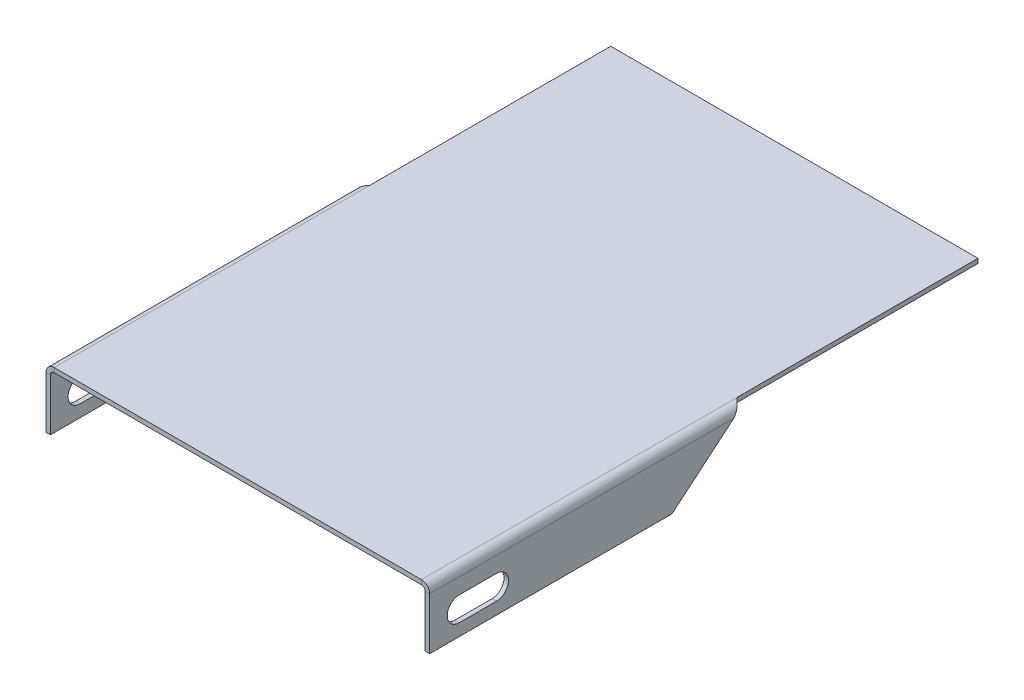
ISO-10303-21;
HEADER;
FILE_DESCRIPTION(('STEP AP214'),'2;1');
FILE_NAME('part.step','',(''),(''),'','','');
FILE_SCHEMA(('AUTOMOTIVE_DESIGN { 1 0 10303 214 1 1 1 1 }'));
ENDSEC;
DATA;
#1=APPLICATION_CONTEXT('core data for automotive mechanical design processes');
#2=APPLICATION_PROTOCOL_DEFINITION('international standard','automotive_design',2000,#1);
#3=PRODUCT_CONTEXT('',#1,'mechanical');
#4=PRODUCT('Part','Part','',(#3));
#5=PRODUCT_RELATED_PRODUCT_CATEGORY('part','',(#4));
#6=PRODUCT_DEFINITION_FORMATION('','',#4);
#7=PRODUCT_DEFINITION_CONTEXT('part definition',#1,'design');
#8=PRODUCT_DEFINITION('design','',#6,#7);
#9=PRODUCT_DEFINITION_SHAPE('','',#8);
#10=(LENGTH_UNIT() NAMED_UNIT(*) SI_UNIT(.MILLI.,.METRE.));
#11=(NAMED_UNIT(*) PLANE_ANGLE_UNIT() SI_UNIT($,.RADIAN.));
#12=(NAMED_UNIT(*) SI_UNIT($,.STERADIAN.) SOLID_ANGLE_UNIT());
#13=UNCERTAINTY_MEASURE_WITH_UNIT(LENGTH_MEASURE(1.E-05),#10,'distance_accuracy_value','');
#14=(GEOMETRIC_REPRESENTATION_CONTEXT(3) GLOBAL_UNCERTAINTY_ASSIGNED_CONTEXT((#13)) GLOBAL_UNIT_ASSIGNED_CONTEXT((#10,
#11,#12)) REPRESENTATION_CONTEXT('',''));
#15=CARTESIAN_POINT('',(0.,0.,0.));
#16=DIRECTION('',(0.,0.,1.));
#17=DIRECTION('',(1.,0.,0.));
#18=AXIS2_PLACEMENT_3D('',#15,#16,#17);
#19=CARTESIAN_POINT('',(-51.7,-8.50000000000001,142.));
#20=DIRECTION('',(-1.,0.,0.));
#21=DIRECTION('',(0.,0.,1.));
#22=AXIS2_PLACEMENT_3D('',#19,#20,#21);
#23=CYLINDRICAL_SURFACE('',#22,3.25);
#24=DIRECTION('',(-1.,0.,0.));
#25=VECTOR('',#24,1.);
#26=CARTESIAN_POINT('',(-51.7,-5.25,142.));
#27=LINE('',#26,#25);
#28=CARTESIAN_POINT('',(-50.5,-5.25,142.));
#29=VERTEX_POINT('',#28);
#30=CARTESIAN_POINT('',(-51.7,-5.25,142.));
#31=VERTEX_POINT('',#30);
#32=EDGE_CURVE('E11',#29,#31,#27,.T.);
#33=ORIENTED_EDGE('',*,*,#32,.F.);
#34=CARTESIAN_POINT('',(-50.5,-8.50000000000001,142.));
#35=DIRECTION('',(-1.,0.,0.));
#36=DIRECTION('',(0.,0.,1.));
#37=AXIS2_PLACEMENT_3D('',#34,#35,#36);
#38=CIRCLE('',#37,3.25);
#39=CARTESIAN_POINT('',(-50.5,-11.75,142.));
#40=VERTEX_POINT('',#39);
#41=EDGE_CURVE('E151',#40,#29,#38,.T.);
#42=ORIENTED_EDGE('',*,*,#41,.F.);
#43=DIRECTION('',(-1.,0.,0.));
#44=VECTOR('',#43,1.);
#45=CARTESIAN_POINT('',(-51.7,-11.75,142.));
#46=LINE('',#45,#44);
#47=CARTESIAN_POINT('',(-51.7,-11.75,142.));
#48=VERTEX_POINT('',#47);
#49=EDGE_CURVE('E49',#40,#48,#46,.T.);
#50=ORIENTED_EDGE('',*,*,#49,.T.);
#51=CARTESIAN_POINT('',(-51.7,-8.50000000000001,142.));
#52=DIRECTION('',(-1.,0.,0.));
#53=DIRECTION('',(0.,0.,1.));
#54=AXIS2_PLACEMENT_3D('',#51,#52,#53);
#55=CIRCLE('',#54,3.25);
#56=EDGE_CURVE('E414',#48,#31,#55,.T.);
#57=ORIENTED_EDGE('',*,*,#56,.T.);
#58=EDGE_LOOP('',(#33,#42,#50,#57));
#59=FACE_BOUND('',#58,.T.);
#60=ADVANCED_FACE('F39',(#59),#23,.F.);
#61=CARTESIAN_POINT('',(-51.7,-11.75,132.));
#62=DIRECTION('',(0.,-1.,0.));
#63=DIRECTION('',(0.,0.,1.));
#64=AXIS2_PLACEMENT_3D('',#61,#62,#63);
#65=PLANE('',#64);
#66=ORIENTED_EDGE('',*,*,#49,.F.);
#67=DIRECTION('',(0.,0.,1.));
#68=VECTOR('',#67,1.);
#69=CARTESIAN_POINT('',(-50.5,-11.75,150.));
#70=LINE('',#69,#68);
#71=CARTESIAN_POINT('',(-50.5,-11.75,132.));
#72=VERTEX_POINT('',#71);
#73=EDGE_CURVE('E164',#72,#40,#70,.T.);
#74=ORIENTED_EDGE('',*,*,#73,.F.);
#75=DIRECTION('',(-1.,0.,0.));
#76=VECTOR('',#75,1.);
#77=CARTESIAN_POINT('',(-51.7,-11.75,132.));
#78=LINE('',#77,#76);
#79=CARTESIAN_POINT('',(-51.7,-11.75,132.));
#80=VERTEX_POINT('',#79);
#81=EDGE_CURVE('E143',#72,#80,#78,.T.);
#82=ORIENTED_EDGE('',*,*,#81,.T.);
#83=DIRECTION('',(0.,0.,1.));
#84=VECTOR('',#83,1.);
#85=CARTESIAN_POINT('',(-51.7,-11.75,132.));
#86=LINE('',#85,#84);
#87=EDGE_CURVE('E416',#80,#48,#86,.T.);
#88=ORIENTED_EDGE('',*,*,#87,.T.);
#89=EDGE_LOOP('',(#66,#74,#82,#88));
#90=FACE_BOUND('',#89,.T.);
#91=ADVANCED_FACE('F547',(#90),#65,.F.);
#92=CARTESIAN_POINT('',(-51.7,-8.5,132.));
#93=DIRECTION('',(-1.,0.,0.));
#94=DIRECTION('',(0.,0.,1.));
#95=AXIS2_PLACEMENT_3D('',#92,#93,#94);
#96=CYLINDRICAL_SURFACE('',#95,3.25);
#97=ORIENTED_EDGE('',*,*,#81,.F.);
#98=CARTESIAN_POINT('',(-50.5,-8.5,132.));
#99=DIRECTION('',(-1.,0.,0.));
#100=DIRECTION('',(0.,0.,1.));
#101=AXIS2_PLACEMENT_3D('',#98,#99,#100);
#102=CIRCLE('',#101,3.25);
#103=CARTESIAN_POINT('',(-50.5,-5.25,132.));
#104=VERTEX_POINT('',#103);
#105=EDGE_CURVE('E149',#104,#72,#102,.T.);
#106=ORIENTED_EDGE('',*,*,#105,.F.);
#107=DIRECTION('',(-1.,0.,0.));
#108=VECTOR('',#107,1.);
#109=CARTESIAN_POINT('',(-51.7,-5.25,132.));
#110=LINE('',#109,#108);
#111=CARTESIAN_POINT('',(-51.7,-5.25,132.));
#112=VERTEX_POINT('',#111);
#113=EDGE_CURVE('E43',#104,#112,#110,.T.);
#114=ORIENTED_EDGE('',*,*,#113,.T.);
#115=CARTESIAN_POINT('',(-51.7,-8.5,132.));
#116=DIRECTION('',(-1.,0.,0.));
#117=DIRECTION('',(0.,0.,1.));
#118=AXIS2_PLACEMENT_3D('',#115,#116,#117);
#119=CIRCLE('',#118,3.25);
#120=EDGE_CURVE('E405',#112,#80,#119,.T.);
#121=ORIENTED_EDGE('',*,*,#120,.T.);
#122=EDGE_LOOP('',(#97,#106,#114,#121));
#123=FACE_BOUND('',#122,.T.);
#124=ADVANCED_FACE('F153',(#123),#96,.F.);
#125=CARTESIAN_POINT('',(51.7,-8.50000000000001,142.));
#126=DIRECTION('',(1.,0.,0.));
#127=DIRECTION('',(0.,0.,-1.));
#128=AXIS2_PLACEMENT_3D('',#125,#126,#127);
#129=CYLINDRICAL_SURFACE('',#128,3.25);
#130=DIRECTION('',(1.,0.,0.));
#131=VECTOR('',#130,1.);
#132=CARTESIAN_POINT('',(51.7,-11.75,142.));
#133=LINE('',#132,#131);
#134=CARTESIAN_POINT('',(50.5,-11.75,142.));
#135=VERTEX_POINT('',#134);
#136=CARTESIAN_POINT('',(51.7,-11.75,142.));
#137=VERTEX_POINT('',#136);
#138=EDGE_CURVE('E144',#135,#137,#133,.T.);
#139=ORIENTED_EDGE('',*,*,#138,.F.);
#140=CARTESIAN_POINT('',(50.5,-8.50000000000001,142.));
#141=DIRECTION('',(-1.,0.,0.));
#142=DIRECTION('',(0.,0.,1.));
#143=AXIS2_PLACEMENT_3D('',#140,#141,#142);
#144=CIRCLE('',#143,3.25);
#145=CARTESIAN_POINT('',(50.5,-5.25000000000001,142.));
#146=VERTEX_POINT('',#145);
#147=EDGE_CURVE('E511',#135,#146,#144,.T.);
#148=ORIENTED_EDGE('',*,*,#147,.T.);
#149=DIRECTION('',(1.,0.,0.));
#150=VECTOR('',#149,1.);
#151=CARTESIAN_POINT('',(51.7,-5.25000000000001,142.));
#152=LINE('',#151,#150);
#153=CARTESIAN_POINT('',(51.7,-5.25000000000001,142.));
#154=VERTEX_POINT('',#153);
#155=EDGE_CURVE('E529',#146,#154,#152,.T.);
#156=ORIENTED_EDGE('',*,*,#155,.T.);
#157=CARTESIAN_POINT('',(51.7,-8.50000000000001,142.));
#158=DIRECTION('',(-1.,0.,0.));
#159=DIRECTION('',(0.,0.,1.));
#160=AXIS2_PLACEMENT_3D('',#157,#158,#159);
#161=CIRCLE('',#160,3.25);
#162=EDGE_CURVE('E441',#137,#154,#161,.T.);
#163=ORIENTED_EDGE('',*,*,#162,.F.);
#164=EDGE_LOOP('',(#139,#148,#156,#163));
#165=FACE_BOUND('',#164,.T.);
#166=ADVANCED_FACE('F703',(#165),#129,.F.);
#167=CARTESIAN_POINT('',(51.7,-5.25000000000001,132.));
#168=DIRECTION('',(0.,-1.,0.));
#169=DIRECTION('',(0.,0.,-1.));
#170=AXIS2_PLACEMENT_3D('',#167,#168,#169);
#171=PLANE('',#170);
#172=ORIENTED_EDGE('',*,*,#155,.F.);
#173=DIRECTION('',(0.,0.,-1.));
#174=VECTOR('',#173,1.);
#175=CARTESIAN_POINT('',(50.5,-5.25000000000001,150.));
#176=LINE('',#175,#174);
#177=CARTESIAN_POINT('',(50.5,-5.25000000000001,132.));
#178=VERTEX_POINT('',#177);
#179=EDGE_CURVE('E455',#146,#178,#176,.T.);
#180=ORIENTED_EDGE('',*,*,#179,.T.);
#181=DIRECTION('',(1.,0.,0.));
#182=VECTOR('',#181,1.);
#183=CARTESIAN_POINT('',(51.7,-5.25000000000001,132.));
#184=LINE('',#183,#182);
#185=CARTESIAN_POINT('',(51.7,-5.25000000000001,132.));
#186=VERTEX_POINT('',#185);
#187=EDGE_CURVE('E57',#178,#186,#184,.T.);
#188=ORIENTED_EDGE('',*,*,#187,.T.);
#189=DIRECTION('',(0.,0.,-1.));
#190=VECTOR('',#189,1.);
#191=CARTESIAN_POINT('',(51.7,-5.25000000000001,132.));
#192=LINE('',#191,#190);
#193=EDGE_CURVE('E444',#154,#186,#192,.T.);
#194=ORIENTED_EDGE('',*,*,#193,.F.);
#195=EDGE_LOOP('',(#172,#180,#188,#194));
#196=FACE_BOUND('',#195,.T.);
#197=ADVANCED_FACE('F708',(#196),#171,.T.);
#198=CARTESIAN_POINT('',(51.7,-8.50000000000001,132.));
#199=DIRECTION('',(1.,0.,0.));
#200=DIRECTION('',(0.,0.,-1.));
#201=AXIS2_PLACEMENT_3D('',#198,#199,#200);
#202=CYLINDRICAL_SURFACE('',#201,3.25);
#203=ORIENTED_EDGE('',*,*,#187,.F.);
#204=CARTESIAN_POINT('',(50.5,-8.50000000000001,132.));
#205=DIRECTION('',(-1.,0.,0.));
#206=DIRECTION('',(0.,0.,1.));
#207=AXIS2_PLACEMENT_3D('',#204,#205,#206);
#208=CIRCLE('',#207,3.25);
#209=CARTESIAN_POINT('',(50.5,-11.75,132.));
#210=VERTEX_POINT('',#209);
#211=EDGE_CURVE('E506',#178,#210,#208,.T.);
#212=ORIENTED_EDGE('',*,*,#211,.T.);
#213=DIRECTION('',(1.,0.,0.));
#214=VECTOR('',#213,1.);
#215=CARTESIAN_POINT('',(51.7,-11.75,132.));
#216=LINE('',#215,#214);
#217=CARTESIAN_POINT('',(51.7,-11.75,132.));
#218=VERTEX_POINT('',#217);
#219=EDGE_CURVE('E523',#210,#218,#216,.T.);
#220=ORIENTED_EDGE('',*,*,#219,.T.);
#221=CARTESIAN_POINT('',(51.7,-8.50000000000001,132.));
#222=DIRECTION('',(-1.,0.,0.));
#223=DIRECTION('',(0.,0.,1.));
#224=AXIS2_PLACEMENT_3D('',#221,#222,#223);
#225=CIRCLE('',#224,3.25);
#226=EDGE_CURVE('E435',#186,#218,#225,.T.);
#227=ORIENTED_EDGE('',*,*,#226,.F.);
#228=EDGE_LOOP('',(#203,#212,#220,#227));
#229=FACE_BOUND('',#228,.T.);
#230=ADVANCED_FACE('F527',(#229),#202,.F.);
#231=CARTESIAN_POINT('',(51.7,-15.,150.));
#232=DIRECTION('',(0.,-1.,0.));
#233=DIRECTION('',(0.,0.,-1.));
#234=AXIS2_PLACEMENT_3D('',#231,#232,#233);
#235=PLANE('',#234);
#236=DIRECTION('',(1.,0.,0.));
#237=VECTOR('',#236,1.);
#238=CARTESIAN_POINT('',(51.7,-15.,150.));
#239=LINE('',#238,#237);
#240=CARTESIAN_POINT('',(50.5,-15.,150.));
#241=VERTEX_POINT('',#240);
#242=CARTESIAN_POINT('',(51.7,-15.,150.));
#243=VERTEX_POINT('',#242);
#244=EDGE_CURVE('E532',#241,#243,#239,.T.);
#245=ORIENTED_EDGE('',*,*,#244,.F.);
#246=DIRECTION('',(0.,0.,-1.));
#247=VECTOR('',#246,1.);
#248=CARTESIAN_POINT('',(50.5,-15.,150.));
#249=LINE('',#248,#247);
#250=CARTESIAN_POINT('',(50.5,-15.,84.6797537614258));
#251=VERTEX_POINT('',#250);
#252=EDGE_CURVE('E498',#241,#251,#249,.T.);
#253=ORIENTED_EDGE('',*,*,#252,.T.);
#254=DIRECTION('',(1.,0.,0.));
#255=VECTOR('',#254,1.);
#256=CARTESIAN_POINT('',(51.7,-15.,84.6797537614258));
#257=LINE('',#256,#255);
#258=CARTESIAN_POINT('',(51.7,-15.,84.6797537614258));
#259=VERTEX_POINT('',#258);
#260=EDGE_CURVE('E567',#251,#259,#257,.T.);
#261=ORIENTED_EDGE('',*,*,#260,.T.);
#262=DIRECTION('',(0.,0.,-1.));
#263=VECTOR('',#262,1.);
#264=CARTESIAN_POINT('',(51.7,-15.,150.));
#265=LINE('',#264,#263);
#266=EDGE_CURVE('E432',#243,#259,#265,.T.);
#267=ORIENTED_EDGE('',*,*,#266,.F.);
#268=EDGE_LOOP('',(#245,#253,#261,#267));
#269=FACE_BOUND('',#268,.T.);
#270=ADVANCED_FACE('F568',(#269),#235,.T.);
#271=CARTESIAN_POINT('',(51.7,1.51327412287184,65.));
#272=DIRECTION('',(0.,0.766044443118982,0.642787609686535));
#273=DIRECTION('',(0.,-0.642787609686535,0.766044443118982));
#274=AXIS2_PLACEMENT_3D('',#271,#272,#273);
#275=PLANE('',#274);
#276=ORIENTED_EDGE('',*,*,#260,.F.);
#277=DIRECTION('',(0.,-0.642787609686535,0.766044443118982));
#278=VECTOR('',#277,1.);
#279=CARTESIAN_POINT('',(50.5,1.51327412287184,65.));
#280=LINE('',#279,#278);
#281=CARTESIAN_POINT('',(50.5,-0.99999999999998,67.9952034651066));
#282=VERTEX_POINT('',#281);
#283=EDGE_CURVE('E172',#282,#251,#280,.T.);
#284=ORIENTED_EDGE('',*,*,#283,.F.);
#285=CARTESIAN_POINT('',(51.7,-0.999999999999961,67.9952034651066));
#286=CARTESIAN_POINT('',(50.5,-0.999999999999972,67.9952034651066));
#287=B_SPLINE_CURVE_WITH_KNOTS('',1,(#285,#286),.UNSPECIFIED.,.F.,.F.,(2,2),(0.,1.),.UNSPECIFIED.);
#288=CARTESIAN_POINT('',(51.7,-0.99999999999998,67.9952034651066));
#289=VERTEX_POINT('',#288);
#290=EDGE_CURVE('E572',#282,#289,#287,.F.);
#291=ORIENTED_EDGE('',*,*,#290,.T.);
#292=DIRECTION('',(0.,-0.642787609686535,0.766044443118982));
#293=VECTOR('',#292,1.);
#294=CARTESIAN_POINT('',(51.7,1.51327412287184,65.));
#295=LINE('',#294,#293);
#296=EDGE_CURVE('E389',#289,#259,#295,.T.);
#297=ORIENTED_EDGE('',*,*,#296,.T.);
#298=EDGE_LOOP('',(#276,#284,#291,#297));
#299=FACE_BOUND('',#298,.T.);
#300=ADVANCED_FACE('F333',(#299),#275,.F.);
#301=CARTESIAN_POINT('',(51.7,-0.999999999999961,67.9952034651066));
#302=CARTESIAN_POINT('',(51.7,-0.711991024451723,67.7455774787));
#303=CARTESIAN_POINT('',(51.6427398886703,-0.424154654409548,67.4960028875888));
#304=CARTESIAN_POINT('',(51.4223300543794,0.107961756816009,66.9968023100711));
#305=CARTESIAN_POINT('',(51.259267053276,0.35200278394484,66.7472020213122));
#306=CARTESIAN_POINT('',(50.8520027839448,0.759267053276019,66.2480014437944));
#307=CARTESIAN_POINT('',(50.607961756816,0.922330054379389,65.9984011550355));
#308=CARTESIAN_POINT('',(50.0758453455904,1.14273988867031,65.4992005775178));
#309=CARTESIAN_POINT('',(49.7880089755483,1.20000000000002,65.2496259864066));
#310=CARTESIAN_POINT('',(49.5,1.20000000000002,65.));
#311=CARTESIAN_POINT('',(50.5,-0.999999999999972,67.9952034651066));
#312=CARTESIAN_POINT('',(50.5,-0.869095215219051,67.7455934690259));
#313=CARTESIAN_POINT('',(50.4739726766683,-0.738252115640694,67.4960028875888));
#314=CARTESIAN_POINT('',(50.3737863883543,-0.496381019629077,66.9968023100711));
#315=CARTESIAN_POINT('',(50.2996668423982,-0.385453280025063,66.7472020213122));
#316=CARTESIAN_POINT('',(50.1145467199749,-0.2003331576018,66.2480014437944));
#317=CARTESIAN_POINT('',(50.0036189803709,-0.126213611645722,65.9984011550355));
#318=CARTESIAN_POINT('',(49.7617478843593,-0.0260273233316658,65.4992005775178));
#319=CARTESIAN_POINT('',(49.6309047847809,0.,65.2496099960807));
#320=CARTESIAN_POINT('',(49.5,0.,65.));
#321=B_SPLINE_SURFACE_WITH_KNOTS('',1,3,((#301,#302,#303,#304,#305,#306,#307,#308,#309,#310),
(#311,#312,#313,#314,#315,#316,#317,#318,#319,#320)),.UNSPECIFIED.,.F.,.F.,.F.,(2,2),(4,2,2,2,
4),(0.,1.),(0.,0.25,0.5,0.75,1.),.UNSPECIFIED.);
#322=CARTESIAN_POINT('',(50.5,-0.999999999999972,67.9952034651066));
#323=CARTESIAN_POINT('',(50.5,-0.869095215219051,67.7455934690259));
#324=CARTESIAN_POINT('',(50.4739726766683,-0.738252115640694,67.4960028875888));
#325=CARTESIAN_POINT('',(50.3737863883543,-0.496381019629077,66.9968023100711));
#326=CARTESIAN_POINT('',(50.2996668423982,-0.385453280025063,66.7472020213122));
#327=CARTESIAN_POINT('',(50.1145467199749,-0.2003331576018,66.2480014437944));
#328=CARTESIAN_POINT('',(50.0036189803709,-0.126213611645722,65.9984011550355));
#329=CARTESIAN_POINT('',(49.7617478843593,-0.0260273233316658,65.4992005775178));
#330=CARTESIAN_POINT('',(49.6309047847809,0.,65.2496099960807));
#331=CARTESIAN_POINT('',(49.5,0.,65.));
#332=B_SPLINE_CURVE_WITH_KNOTS('',3,(#322,#323,#324,#325,#326,#327,#328,#329,#330,#331),
.UNSPECIFIED.,.F.,.F.,(4,2,2,2,4),(0.,0.25,0.5,0.75,1.),.UNSPECIFIED.);
#333=CARTESIAN_POINT('',(49.5,0.,65.));
#334=VERTEX_POINT('',#333);
#335=EDGE_CURVE('E454',#282,#334,#332,.T.);
#336=CARTESIAN_POINT('',(49.5,0.,65.));
#337=CARTESIAN_POINT('',(49.5,1.20000000000002,65.));
#338=B_SPLINE_CURVE_WITH_KNOTS('',1,(#336,#337),.UNSPECIFIED.,.F.,.F.,(2,2),(0.,1.),.UNSPECIFIED.);
#339=CARTESIAN_POINT('',(49.5,1.20000000000002,65.));
#340=VERTEX_POINT('',#339);
#341=EDGE_CURVE('E307',#334,#340,#338,.T.);
#342=CARTESIAN_POINT('',(49.5,1.20000000000002,65.));
#343=CARTESIAN_POINT('',(49.7880089755483,1.20000000000002,65.2496259864066));
#344=CARTESIAN_POINT('',(50.0758453455904,1.14273988867031,65.4992005775178));
#345=CARTESIAN_POINT('',(50.607961756816,0.922330054379389,65.9984011550355));
#346=CARTESIAN_POINT('',(50.8520027839448,0.759267053276019,66.2480014437944));
#347=CARTESIAN_POINT('',(51.259267053276,0.35200278394484,66.7472020213122));
#348=CARTESIAN_POINT('',(51.4223300543794,0.107961756816009,66.9968023100711));
#349=CARTESIAN_POINT('',(51.6427398886703,-0.424154654409548,67.4960028875888));
#350=CARTESIAN_POINT('',(51.7,-0.711991024451723,67.7455774787));
#351=CARTESIAN_POINT('',(51.7,-0.999999999999961,67.9952034651066));
#352=B_SPLINE_CURVE_WITH_KNOTS('',3,(#342,#343,#344,#345,#346,#347,#348,#349,#350,#351),
.UNSPECIFIED.,.F.,.F.,(4,2,2,2,4),(0.,0.25,0.5,0.75,1.),.UNSPECIFIED.);
#353=EDGE_CURVE('E450',#289,#340,#352,.F.);
#354=ORIENTED_EDGE('',*,*,#290,.F.);
#355=ORIENTED_EDGE('',*,*,#335,.T.);
#356=ORIENTED_EDGE('',*,*,#341,.T.);
#357=ORIENTED_EDGE('',*,*,#353,.F.);
#358=EDGE_LOOP('',(#354,#355,#356,#357));
#359=FACE_BOUND('',#358,.T.);
#360=ADVANCED_FACE('F320',(#359),#321,.T.);
#361=CARTESIAN_POINT('',(49.5,1.20000000000002,0.));
#362=DIRECTION('',(-1.,0.,0.));
#363=DIRECTION('',(0.,0.,1.));
#364=AXIS2_PLACEMENT_3D('',#361,#362,#363);
#365=PLANE('',#364);
#366=ORIENTED_EDGE('',*,*,#341,.F.);
#367=DIRECTION('',(0.,0.,1.));
#368=VECTOR('',#367,1.);
#369=CARTESIAN_POINT('',(49.5,0.,150.));
#370=LINE('',#369,#368);
#371=CARTESIAN_POINT('',(49.5,0.,0.));
#372=VERTEX_POINT('',#371);
#373=EDGE_CURVE('E178',#372,#334,#370,.T.);
#374=ORIENTED_EDGE('',*,*,#373,.F.);
#375=DIRECTION('',(0.,1.,0.));
#376=VECTOR('',#375,1.);
#377=CARTESIAN_POINT('',(49.5,1.20000000000002,0.));
#378=LINE('',#377,#376);
#379=CARTESIAN_POINT('',(49.5,1.20000000000002,0.));
#380=VERTEX_POINT('',#379);
#381=EDGE_CURVE('E304',#372,#380,#378,.T.);
#382=ORIENTED_EDGE('',*,*,#381,.T.);
#383=DIRECTION('',(0.,0.,1.));
#384=VECTOR('',#383,1.);
#385=CARTESIAN_POINT('',(49.5,1.20000000000002,0.));
#386=LINE('',#385,#384);
#387=EDGE_CURVE('E397',#380,#340,#386,.T.);
#388=ORIENTED_EDGE('',*,*,#387,.T.);
#389=EDGE_LOOP('',(#366,#374,#382,#388));
#390=FACE_BOUND('',#389,.T.);
#391=ADVANCED_FACE('F332',(#390),#365,.F.);
#392=CARTESIAN_POINT('',(-50.5,1.2,0.));
#393=DIRECTION('',(0.,0.,1.));
#394=DIRECTION('',(1.,0.,0.));
#395=AXIS2_PLACEMENT_3D('',#392,#393,#394);
#396=PLANE('',#395);
#397=ORIENTED_EDGE('',*,*,#381,.F.);
#398=DIRECTION('',(-1.,0.,0.));
#399=VECTOR('',#398,1.);
#400=CARTESIAN_POINT('',(-50.5,0.,0.));
#401=LINE('',#400,#399);
#402=CARTESIAN_POINT('',(-49.5,0.,0.));
#403=VERTEX_POINT('',#402);
#404=EDGE_CURVE('E198',#403,#372,#401,.F.);
#405=ORIENTED_EDGE('',*,*,#404,.F.);
#406=DIRECTION('',(0.,1.,0.));
#407=VECTOR('',#406,1.);
#408=CARTESIAN_POINT('',(-49.5,1.2,0.));
#409=LINE('',#408,#407);
#410=CARTESIAN_POINT('',(-49.5,1.2,0.));
#411=VERTEX_POINT('',#410);
#412=EDGE_CURVE('E296',#403,#411,#409,.T.);
#413=ORIENTED_EDGE('',*,*,#412,.T.);
#414=DIRECTION('',(1.,0.,0.));
#415=VECTOR('',#414,1.);
#416=CARTESIAN_POINT('',(-50.5,1.2,0.));
#417=LINE('',#416,#415);
#418=EDGE_CURVE('E607',#411,#380,#417,.T.);
#419=ORIENTED_EDGE('',*,*,#418,.T.);
#420=EDGE_LOOP('',(#397,#405,#413,#419));
#421=FACE_BOUND('',#420,.T.);
#422=ADVANCED_FACE('F730',(#421),#396,.F.);
#423=CARTESIAN_POINT('',(-49.5,1.2,0.));
#424=DIRECTION('',(1.,0.,0.));
#425=DIRECTION('',(0.,0.,-1.));
#426=AXIS2_PLACEMENT_3D('',#423,#424,#425);
#427=PLANE('',#426);
#428=ORIENTED_EDGE('',*,*,#412,.F.);
#429=DIRECTION('',(0.,0.,1.));
#430=VECTOR('',#429,1.);
#431=CARTESIAN_POINT('',(-49.5,0.,150.));
#432=LINE('',#431,#430);
#433=CARTESIAN_POINT('',(-49.5,0.,65.));
#434=VERTEX_POINT('',#433);
#435=EDGE_CURVE('E185',#434,#403,#432,.F.);
#436=ORIENTED_EDGE('',*,*,#435,.F.);
#437=CARTESIAN_POINT('',(-49.5,1.2,65.));
#438=CARTESIAN_POINT('',(-49.5,0.,65.));
#439=B_SPLINE_CURVE_WITH_KNOTS('',1,(#437,#438),.UNSPECIFIED.,.F.,.F.,(2,2),(0.,1.),.UNSPECIFIED.);
#440=CARTESIAN_POINT('',(-49.5,1.2,65.));
#441=VERTEX_POINT('',#440);
#442=EDGE_CURVE('E283',#434,#441,#439,.F.);
#443=ORIENTED_EDGE('',*,*,#442,.T.);
#444=DIRECTION('',(0.,0.,-1.));
#445=VECTOR('',#444,1.);
#446=CARTESIAN_POINT('',(-49.5,1.2,0.));
#447=LINE('',#446,#445);
#448=EDGE_CURVE('E612',#441,#411,#447,.T.);
#449=ORIENTED_EDGE('',*,*,#448,.T.);
#450=EDGE_LOOP('',(#428,#436,#443,#449));
#451=FACE_BOUND('',#450,.T.);
#452=ADVANCED_FACE('F237',(#451),#427,.F.);
#453=CARTESIAN_POINT('',(-49.5,1.2,65.));
#454=CARTESIAN_POINT('',(-49.7880089755482,1.2,65.2496259864066));
#455=CARTESIAN_POINT('',(-50.0758453455904,1.1427398886703,65.4992005775178));
#456=CARTESIAN_POINT('',(-50.607961756816,0.922330054379371,65.9984011550356));
#457=CARTESIAN_POINT('',(-50.8520027839448,0.759267053275999,66.2480014437945));
#458=CARTESIAN_POINT('',(-51.259267053276,0.352002783944813,66.7472020213122));
#459=CARTESIAN_POINT('',(-51.4223300543794,0.107961756815978,66.9968023100711));
#460=CARTESIAN_POINT('',(-51.6427398886703,-0.424154654409588,67.4960028875889));
#461=CARTESIAN_POINT('',(-51.7,-0.711991024451759,67.7455774787001));
#462=CARTESIAN_POINT('',(-51.7,-1.00000000000001,67.9952034651066));
#463=CARTESIAN_POINT('',(-49.5,0.,65.));
#464=CARTESIAN_POINT('',(-49.6309047847809,0.,65.2496099960807));
#465=CARTESIAN_POINT('',(-49.7617478843593,-0.0260273233316826,65.4992005775178));
#466=CARTESIAN_POINT('',(-50.0036189803709,-0.12621361164574,65.9984011550356));
#467=CARTESIAN_POINT('',(-50.1145467199749,-0.200333157601818,66.2480014437945));
#468=CARTESIAN_POINT('',(-50.2996668423982,-0.385453280025085,66.7472020213122));
#469=CARTESIAN_POINT('',(-50.3737863883543,-0.496381019629101,66.9968023100711));
#470=CARTESIAN_POINT('',(-50.4739726766683,-0.738252115640722,67.4960028875889));
#471=CARTESIAN_POINT('',(-50.5,-0.869095215219083,67.7455934690259));
#472=CARTESIAN_POINT('',(-50.5,-1.,67.9952034651066));
#473=B_SPLINE_SURFACE_WITH_KNOTS('',1,3,((#453,#454,#455,#456,#457,#458,#459,#460,#461,#462),
(#463,#464,#465,#466,#467,#468,#469,#470,#471,#472)),.UNSPECIFIED.,.F.,.F.,.F.,(2,2),(4,2,2,2,
4),(0.,1.),(0.,0.25,0.5,0.75,1.),.UNSPECIFIED.);
#474=CARTESIAN_POINT('',(-49.5,0.,65.));
#475=CARTESIAN_POINT('',(-49.6309047847809,0.,65.2496099960807));
#476=CARTESIAN_POINT('',(-49.7617478843593,-0.0260273233316826,65.4992005775178));
#477=CARTESIAN_POINT('',(-50.0036189803709,-0.12621361164574,65.9984011550356));
#478=CARTESIAN_POINT('',(-50.1145467199749,-0.200333157601818,66.2480014437945));
#479=CARTESIAN_POINT('',(-50.2996668423982,-0.385453280025085,66.7472020213122));
#480=CARTESIAN_POINT('',(-50.3737863883543,-0.496381019629101,66.9968023100711));
#481=CARTESIAN_POINT('',(-50.4739726766683,-0.738252115640722,67.4960028875889));
#482=CARTESIAN_POINT('',(-50.5,-0.869095215219083,67.7455934690259));
#483=CARTESIAN_POINT('',(-50.5,-1.,67.9952034651066));
#484=B_SPLINE_CURVE_WITH_KNOTS('',3,(#474,#475,#476,#477,#478,#479,#480,#481,#482,#483),
.UNSPECIFIED.,.F.,.F.,(4,2,2,2,4),(0.,0.25,0.5,0.75,1.),.UNSPECIFIED.);
#485=CARTESIAN_POINT('',(-50.5,-1.,67.9952034651066));
#486=VERTEX_POINT('',#485);
#487=EDGE_CURVE('E207',#434,#486,#484,.T.);
#488=CARTESIAN_POINT('',(-50.5,-1.,67.9952034651066));
#489=CARTESIAN_POINT('',(-51.7,-1.00000000000001,67.9952034651066));
#490=B_SPLINE_CURVE_WITH_KNOTS('',1,(#488,#489),.UNSPECIFIED.,.F.,.F.,(2,2),(0.,1.),.UNSPECIFIED.);
#491=CARTESIAN_POINT('',(-51.7,-1.00000000000001,67.9952034651066));
#492=VERTEX_POINT('',#491);
#493=EDGE_CURVE('E269',#486,#492,#490,.T.);
#494=CARTESIAN_POINT('',(-51.7,-1.00000000000001,67.9952034651066));
#495=CARTESIAN_POINT('',(-51.7,-0.711991024451759,67.7455774787001));
#496=CARTESIAN_POINT('',(-51.6427398886703,-0.424154654409588,67.4960028875889));
#497=CARTESIAN_POINT('',(-51.4223300543794,0.107961756815978,66.9968023100711));
#498=CARTESIAN_POINT('',(-51.259267053276,0.352002783944813,66.7472020213122));
#499=CARTESIAN_POINT('',(-50.8520027839448,0.759267053275999,66.2480014437945));
#500=CARTESIAN_POINT('',(-50.607961756816,0.922330054379371,65.9984011550356));
#501=CARTESIAN_POINT('',(-50.0758453455904,1.1427398886703,65.4992005775178));
#502=CARTESIAN_POINT('',(-49.7880089755482,1.2,65.2496259864066));
#503=CARTESIAN_POINT('',(-49.5,1.2,65.));
#504=B_SPLINE_CURVE_WITH_KNOTS('',3,(#494,#495,#496,#497,#498,#499,#500,#501,#502,#503),
.UNSPECIFIED.,.F.,.F.,(4,2,2,2,4),(0.,0.25,0.5,0.75,1.),.UNSPECIFIED.);
#505=EDGE_CURVE('E216',#441,#492,#504,.F.);
#506=ORIENTED_EDGE('',*,*,#442,.F.);
#507=ORIENTED_EDGE('',*,*,#487,.T.);
#508=ORIENTED_EDGE('',*,*,#493,.T.);
#509=ORIENTED_EDGE('',*,*,#505,.F.);
#510=EDGE_LOOP('',(#506,#507,#508,#509));
#511=FACE_BOUND('',#510,.T.);
#512=ADVANCED_FACE('F224',(#511),#473,.T.);
#513=CARTESIAN_POINT('',(-51.7,1.51327412287185,65.));
#514=DIRECTION('',(0.,0.766044443118982,0.642787609686535));
#515=DIRECTION('',(0.,0.642787609686535,-0.766044443118982));
#516=AXIS2_PLACEMENT_3D('',#513,#514,#515);
#517=PLANE('',#516);
#518=ORIENTED_EDGE('',*,*,#493,.F.);
#519=DIRECTION('',(0.,0.642787609686535,-0.766044443118982));
#520=VECTOR('',#519,1.);
#521=CARTESIAN_POINT('',(-50.5,1.51327412287185,65.));
#522=LINE('',#521,#520);
#523=CARTESIAN_POINT('',(-50.5,-15.,84.6797537614258));
#524=VERTEX_POINT('',#523);
#525=EDGE_CURVE('E190',#524,#486,#522,.T.);
#526=ORIENTED_EDGE('',*,*,#525,.F.);
#527=DIRECTION('',(-1.,0.,0.));
#528=VECTOR('',#527,1.);
#529=CARTESIAN_POINT('',(-51.7,-15.,84.6797537614258));
#530=LINE('',#529,#528);
#531=CARTESIAN_POINT('',(-51.7,-15.,84.6797537614258));
#532=VERTEX_POINT('',#531);
#533=EDGE_CURVE('E371',#524,#532,#530,.T.);
#534=ORIENTED_EDGE('',*,*,#533,.T.);
#535=DIRECTION('',(0.,0.642787609686535,-0.766044443118982));
#536=VECTOR('',#535,1.);
#537=CARTESIAN_POINT('',(-51.7,1.51327412287185,65.));
#538=LINE('',#537,#536);
#539=EDGE_CURVE('E392',#532,#492,#538,.T.);
#540=ORIENTED_EDGE('',*,*,#539,.T.);
#541=EDGE_LOOP('',(#518,#526,#534,#540));
#542=FACE_BOUND('',#541,.T.);
#543=ADVANCED_FACE('F236',(#542),#517,.F.);
#544=CARTESIAN_POINT('',(-51.7,-15.,150.));
#545=DIRECTION('',(0.,1.,0.));
#546=DIRECTION('',(0.,0.,-1.));
#547=AXIS2_PLACEMENT_3D('',#544,#545,#546);
#548=PLANE('',#547);
#549=ORIENTED_EDGE('',*,*,#533,.F.);
#550=DIRECTION('',(0.,0.,1.));
#551=VECTOR('',#550,1.);
#552=CARTESIAN_POINT('',(-50.5,-15.,150.));
#553=LINE('',#552,#551);
#554=CARTESIAN_POINT('',(-50.5,-15.,150.));
#555=VERTEX_POINT('',#554);
#556=EDGE_CURVE('E193',#555,#524,#553,.F.);
#557=ORIENTED_EDGE('',*,*,#556,.F.);
#558=DIRECTION('',(-1.,0.,0.));
#559=VECTOR('',#558,1.);
#560=CARTESIAN_POINT('',(-51.7,-15.,150.));
#561=LINE('',#560,#559);
#562=CARTESIAN_POINT('',(-51.7,-15.,150.));
#563=VERTEX_POINT('',#562);
#564=EDGE_CURVE('E369',#555,#563,#561,.T.);
#565=ORIENTED_EDGE('',*,*,#564,.T.);
#566=DIRECTION('',(0.,0.,-1.));
#567=VECTOR('',#566,1.);
#568=CARTESIAN_POINT('',(-51.7,-15.,150.));
#569=LINE('',#568,#567);
#570=EDGE_CURVE('E396',#563,#532,#569,.T.);
#571=ORIENTED_EDGE('',*,*,#570,.T.);
#572=EDGE_LOOP('',(#549,#557,#565,#571));
#573=FACE_BOUND('',#572,.T.);
#574=ADVANCED_FACE('F641',(#573),#548,.F.);
#575=CARTESIAN_POINT('',(-51.7,-15.,150.));
#576=DIRECTION('',(0.,0.,1.));
#577=DIRECTION('',(0.,1.,0.));
#578=AXIS2_PLACEMENT_3D('',#575,#576,#577);
#579=PLANE('',#578);
#580=ORIENTED_EDGE('',*,*,#564,.F.);
#581=DIRECTION('',(0.,1.,0.));
#582=VECTOR('',#581,1.);
#583=CARTESIAN_POINT('',(-50.5,-15.,150.));
#584=LINE('',#583,#582);
#585=CARTESIAN_POINT('',(-50.5,-0.999999999999999,150.));
#586=VERTEX_POINT('',#585);
#587=EDGE_CURVE('E158',#555,#586,#584,.T.);
#588=ORIENTED_EDGE('',*,*,#587,.T.);
#589=DIRECTION('',(-1.,0.,0.));
#590=VECTOR('',#589,1.);
#591=CARTESIAN_POINT('',(-51.7,-0.999999999999999,150.));
#592=LINE('',#591,#590);
#593=CARTESIAN_POINT('',(-51.7,-0.999999999999999,150.));
#594=VERTEX_POINT('',#593);
#595=EDGE_CURVE('E366',#586,#594,#592,.T.);
#596=ORIENTED_EDGE('',*,*,#595,.T.);
#597=DIRECTION('',(0.,1.,0.));
#598=VECTOR('',#597,1.);
#599=CARTESIAN_POINT('',(-51.7,-15.,150.));
#600=LINE('',#599,#598);
#601=EDGE_CURVE('E403',#563,#594,#600,.T.);
#602=ORIENTED_EDGE('',*,*,#601,.F.);
#603=EDGE_LOOP('',(#580,#588,#596,#602));
#604=FACE_BOUND('',#603,.T.);
#605=ADVANCED_FACE('F647',(#604),#579,.T.);
#606=CARTESIAN_POINT('',(-49.5,-1.,150.));
#607=DIRECTION('',(0.,0.,1.));
#608=DIRECTION('',(1.,0.,0.));
#609=AXIS2_PLACEMENT_3D('',#606,#607,#608);
#610=PLANE('',#609);
#611=ORIENTED_EDGE('',*,*,#595,.F.);
#612=CARTESIAN_POINT('',(-49.5,-1.,150.));
#613=DIRECTION('',(0.,0.,1.));
#614=DIRECTION('',(1.,0.,0.));
#615=AXIS2_PLACEMENT_3D('',#612,#613,#614);
#616=CIRCLE('',#615,1.);
#617=CARTESIAN_POINT('',(-49.5,0.,150.));
#618=VERTEX_POINT('',#617);
#619=EDGE_CURVE('E166',#586,#618,#616,.F.);
#620=ORIENTED_EDGE('',*,*,#619,.T.);
#621=DIRECTION('',(0.,1.,0.));
#622=VECTOR('',#621,1.);
#623=CARTESIAN_POINT('',(-49.5,1.2,150.));
#624=LINE('',#623,#622);
#625=CARTESIAN_POINT('',(-49.5,1.2,150.));
#626=VERTEX_POINT('',#625);
#627=EDGE_CURVE('E362',#618,#626,#624,.T.);
#628=ORIENTED_EDGE('',*,*,#627,.T.);
#629=CARTESIAN_POINT('',(-49.5,-1.,150.));
#630=DIRECTION('',(0.,0.,-1.));
#631=DIRECTION('',(-1.,0.,0.));
#632=AXIS2_PLACEMENT_3D('',#629,#630,#631);
#633=CIRCLE('',#632,2.2);
#634=EDGE_CURVE('E390',#594,#626,#633,.T.);
#635=ORIENTED_EDGE('',*,*,#634,.F.);
#636=EDGE_LOOP('',(#611,#620,#628,#635));
#637=FACE_BOUND('',#636,.T.);
#638=ADVANCED_FACE('F651',(#637),#610,.T.);
#639=CARTESIAN_POINT('',(-50.5,1.2,150.));
#640=DIRECTION('',(0.,0.,1.));
#641=DIRECTION('',(1.,0.,0.));
#642=AXIS2_PLACEMENT_3D('',#639,#640,#641);
#643=PLANE('',#642);
#644=ORIENTED_EDGE('',*,*,#627,.F.);
#645=DIRECTION('',(-1.,0.,0.));
#646=VECTOR('',#645,1.);
#647=CARTESIAN_POINT('',(-50.5,0.,150.));
#648=LINE('',#647,#646);
#649=CARTESIAN_POINT('',(49.5,0.,150.));
#650=VERTEX_POINT('',#649);
#651=EDGE_CURVE('E179',#618,#650,#648,.F.);
#652=ORIENTED_EDGE('',*,*,#651,.T.);
#653=DIRECTION('',(0.,1.,0.));
#654=VECTOR('',#653,1.);
#655=CARTESIAN_POINT('',(49.5,1.20000000000002,150.));
#656=LINE('',#655,#654);
#657=CARTESIAN_POINT('',(49.5,1.20000000000002,150.));
#658=VERTEX_POINT('',#657);
#659=EDGE_CURVE('E354',#650,#658,#656,.T.);
#660=ORIENTED_EDGE('',*,*,#659,.T.);
#661=DIRECTION('',(1.,0.,0.));
#662=VECTOR('',#661,1.);
#663=CARTESIAN_POINT('',(-50.5,1.2,150.));
#664=LINE('',#663,#662);
#665=EDGE_CURVE('E626',#626,#658,#664,.T.);
#666=ORIENTED_EDGE('',*,*,#665,.F.);
#667=EDGE_LOOP('',(#644,#652,#660,#666));
#668=FACE_BOUND('',#667,.T.);
#669=ADVANCED_FACE('F659',(#668),#643,.T.);
#670=CARTESIAN_POINT('',(49.5,-0.999999999999982,150.));
#671=DIRECTION('',(0.,0.,1.));
#672=DIRECTION('',(1.,0.,0.));
#673=AXIS2_PLACEMENT_3D('',#670,#671,#672);
#674=PLANE('',#673);
#675=ORIENTED_EDGE('',*,*,#659,.F.);
#676=CARTESIAN_POINT('',(49.5,-0.999999999999982,150.));
#677=DIRECTION('',(0.,0.,-1.));
#678=DIRECTION('',(-1.,0.,0.));
#679=AXIS2_PLACEMENT_3D('',#676,#677,#678);
#680=CIRCLE('',#679,1.);
#681=CARTESIAN_POINT('',(50.5,-0.999999999999988,150.));
#682=VERTEX_POINT('',#681);
#683=EDGE_CURVE('E451',#650,#682,#680,.T.);
#684=ORIENTED_EDGE('',*,*,#683,.T.);
#685=DIRECTION('',(1.,0.,0.));
#686=VECTOR('',#685,1.);
#687=CARTESIAN_POINT('',(51.7,-0.999999999999988,150.));
#688=LINE('',#687,#686);
#689=CARTESIAN_POINT('',(51.7,-0.999999999999988,150.));
#690=VERTEX_POINT('',#689);
#691=EDGE_CURVE('E363',#682,#690,#688,.T.);
#692=ORIENTED_EDGE('',*,*,#691,.T.);
#693=CARTESIAN_POINT('',(49.5,-0.999999999999982,150.));
#694=DIRECTION('',(0.,0.,-1.));
#695=DIRECTION('',(-1.,0.,0.));
#696=AXIS2_PLACEMENT_3D('',#693,#694,#695);
#697=CIRCLE('',#696,2.2);
#698=EDGE_CURVE('E447',#658,#690,#697,.T.);
#699=ORIENTED_EDGE('',*,*,#698,.F.);
#700=EDGE_LOOP('',(#675,#684,#692,#699));
#701=FACE_BOUND('',#700,.T.);
#702=ADVANCED_FACE('F772',(#701),#674,.T.);
#703=CARTESIAN_POINT('',(-51.7,-5.25,132.));
#704=DIRECTION('',(0.,1.,0.));
#705=DIRECTION('',(0.,0.,-1.));
#706=AXIS2_PLACEMENT_3D('',#703,#704,#705);
#707=PLANE('',#706);
#708=DIRECTION('',(0.,0.,1.));
#709=VECTOR('',#708,1.);
#710=CARTESIAN_POINT('',(-50.5,-5.25,150.));
#711=LINE('',#710,#709);
#712=EDGE_CURVE('E135',#29,#104,#711,.F.);
#713=ORIENTED_EDGE('',*,*,#712,.F.);
#714=ORIENTED_EDGE('',*,*,#32,.T.);
#715=DIRECTION('',(0.,0.,-1.));
#716=VECTOR('',#715,1.);
#717=CARTESIAN_POINT('',(-51.7,-5.25,132.));
#718=LINE('',#717,#716);
#719=EDGE_CURVE('E138',#31,#112,#718,.T.);
#720=ORIENTED_EDGE('',*,*,#719,.T.);
#721=ORIENTED_EDGE('',*,*,#113,.F.);
#722=EDGE_LOOP('',(#713,#714,#720,#721));
#723=FACE_BOUND('',#722,.T.);
#724=ADVANCED_FACE('F41',(#723),#707,.F.);
#725=CARTESIAN_POINT('',(51.7,-11.75,132.));
#726=DIRECTION('',(0.,1.,0.));
#727=DIRECTION('',(0.,0.,1.));
#728=AXIS2_PLACEMENT_3D('',#725,#726,#727);
#729=PLANE('',#728);
#730=DIRECTION('',(0.,0.,-1.));
#731=VECTOR('',#730,1.);
#732=CARTESIAN_POINT('',(50.5,-11.75,150.));
#733=LINE('',#732,#731);
#734=EDGE_CURVE('E162',#210,#135,#733,.F.);
#735=ORIENTED_EDGE('',*,*,#734,.T.);
#736=ORIENTED_EDGE('',*,*,#138,.T.);
#737=DIRECTION('',(0.,0.,1.));
#738=VECTOR('',#737,1.);
#739=CARTESIAN_POINT('',(51.7,-11.75,132.));
#740=LINE('',#739,#738);
#741=EDGE_CURVE('E438',#218,#137,#740,.T.);
#742=ORIENTED_EDGE('',*,*,#741,.F.);
#743=ORIENTED_EDGE('',*,*,#219,.F.);
#744=EDGE_LOOP('',(#735,#736,#742,#743));
#745=FACE_BOUND('',#744,.T.);
#746=ADVANCED_FACE('F520',(#745),#729,.T.);
#747=CARTESIAN_POINT('',(51.7,0.,150.));
#748=DIRECTION('',(0.,0.,-1.));
#749=DIRECTION('',(0.,1.,0.));
#750=AXIS2_PLACEMENT_3D('',#747,#748,#749);
#751=PLANE('',#750);
#752=DIRECTION('',(0.,1.,0.));
#753=VECTOR('',#752,1.);
#754=CARTESIAN_POINT('',(50.5,0.,150.));
#755=LINE('',#754,#753);
#756=EDGE_CURVE('E171',#682,#241,#755,.F.);
#757=ORIENTED_EDGE('',*,*,#756,.T.);
#758=ORIENTED_EDGE('',*,*,#244,.T.);
#759=DIRECTION('',(0.,1.,0.));
#760=VECTOR('',#759,1.);
#761=CARTESIAN_POINT('',(51.7,0.,150.));
#762=LINE('',#761,#760);
#763=EDGE_CURVE('E427',#690,#243,#762,.F.);
#764=ORIENTED_EDGE('',*,*,#763,.F.);
#765=ORIENTED_EDGE('',*,*,#691,.F.);
#766=EDGE_LOOP('',(#757,#758,#764,#765));
#767=FACE_BOUND('',#766,.T.);
#768=ADVANCED_FACE('F600',(#767),#751,.F.);
#769=CARTESIAN_POINT('',(49.5,-0.999999999999982,192.545614506668));
#770=DIRECTION('',(0.,0.,-1.));
#771=DIRECTION('',(-1.,0.,0.));
#772=AXIS2_PLACEMENT_3D('',#769,#770,#771);
#773=CYLINDRICAL_SURFACE('',#772,2.2);
#774=ORIENTED_EDGE('',*,*,#698,.T.);
#775=DIRECTION('',(0.,0.,-1.));
#776=VECTOR('',#775,1.);
#777=CARTESIAN_POINT('',(51.7,-0.999999999999994,150.));
#778=LINE('',#777,#776);
#779=EDGE_CURVE('E422',#690,#289,#778,.T.);
#780=ORIENTED_EDGE('',*,*,#779,.T.);
#781=ORIENTED_EDGE('',*,*,#353,.T.);
#782=DIRECTION('',(0.,0.,-1.));
#783=VECTOR('',#782,1.);
#784=CARTESIAN_POINT('',(49.5,1.20000000000002,150.));
#785=LINE('',#784,#783);
#786=EDGE_CURVE('E631',#658,#340,#785,.T.);
#787=ORIENTED_EDGE('',*,*,#786,.F.);
#788=EDGE_LOOP('',(#774,#780,#781,#787));
#789=FACE_BOUND('',#788,.T.);
#790=ADVANCED_FACE('F483',(#789),#773,.T.);
#791=CARTESIAN_POINT('',(51.7,0.,150.));
#792=DIRECTION('',(1.,0.,0.));
#793=DIRECTION('',(0.,0.,-1.));
#794=AXIS2_PLACEMENT_3D('',#791,#792,#793);
#795=PLANE('',#794);
#796=ORIENTED_EDGE('',*,*,#296,.F.);
#797=ORIENTED_EDGE('',*,*,#779,.F.);
#798=ORIENTED_EDGE('',*,*,#763,.T.);
#799=ORIENTED_EDGE('',*,*,#266,.T.);
#800=EDGE_LOOP('',(#796,#797,#798,#799));
#801=FACE_BOUND('',#800,.T.);
#802=ORIENTED_EDGE('',*,*,#226,.T.);
#803=ORIENTED_EDGE('',*,*,#741,.T.);
#804=ORIENTED_EDGE('',*,*,#162,.T.);
#805=ORIENTED_EDGE('',*,*,#193,.T.);
#806=EDGE_LOOP('',(#802,#803,#804,#805));
#807=FACE_BOUND('',#806,.T.);
#808=ADVANCED_FACE('F576',(#801,#807),#795,.T.);
#809=CARTESIAN_POINT('',(-49.5,-1.,22.4543854933325));
#810=DIRECTION('',(0.,0.,1.));
#811=DIRECTION('',(1.,0.,0.));
#812=AXIS2_PLACEMENT_3D('',#809,#810,#811);
#813=CYLINDRICAL_SURFACE('',#812,2.2);
#814=ORIENTED_EDGE('',*,*,#634,.T.);
#815=DIRECTION('',(0.,0.,-1.));
#816=VECTOR('',#815,1.);
#817=CARTESIAN_POINT('',(-49.5,1.2,150.));
#818=LINE('',#817,#816);
#819=EDGE_CURVE('E387',#626,#441,#818,.T.);
#820=ORIENTED_EDGE('',*,*,#819,.T.);
#821=ORIENTED_EDGE('',*,*,#505,.T.);
#822=DIRECTION('',(0.,0.,-1.));
#823=VECTOR('',#822,1.);
#824=CARTESIAN_POINT('',(-51.7,-1.,150.));
#825=LINE('',#824,#823);
#826=EDGE_CURVE('E385',#594,#492,#825,.T.);
#827=ORIENTED_EDGE('',*,*,#826,.F.);
#828=EDGE_LOOP('',(#814,#820,#821,#827));
#829=FACE_BOUND('',#828,.T.);
#830=ADVANCED_FACE('F383',(#829),#813,.T.);
#831=CARTESIAN_POINT('',(-51.7,-15.,150.));
#832=DIRECTION('',(-1.,0.,0.));
#833=DIRECTION('',(0.,0.,1.));
#834=AXIS2_PLACEMENT_3D('',#831,#832,#833);
#835=PLANE('',#834);
#836=ORIENTED_EDGE('',*,*,#539,.F.);
#837=ORIENTED_EDGE('',*,*,#570,.F.);
#838=ORIENTED_EDGE('',*,*,#601,.T.);
#839=ORIENTED_EDGE('',*,*,#826,.T.);
#840=EDGE_LOOP('',(#836,#837,#838,#839));
#841=FACE_BOUND('',#840,.T.);
#842=ORIENTED_EDGE('',*,*,#120,.F.);
#843=ORIENTED_EDGE('',*,*,#719,.F.);
#844=ORIENTED_EDGE('',*,*,#56,.F.);
#845=ORIENTED_EDGE('',*,*,#87,.F.);
#846=EDGE_LOOP('',(#842,#843,#844,#845));
#847=FACE_BOUND('',#846,.T.);
#848=ADVANCED_FACE('F400',(#841,#847),#835,.T.);
#849=CARTESIAN_POINT('',(-50.5,1.2,150.));
#850=DIRECTION('',(0.,1.,0.));
#851=DIRECTION('',(-1.,0.,0.));
#852=AXIS2_PLACEMENT_3D('',#849,#850,#851);
#853=PLANE('',#852);
#854=ORIENTED_EDGE('',*,*,#418,.F.);
#855=ORIENTED_EDGE('',*,*,#448,.F.);
#856=ORIENTED_EDGE('',*,*,#819,.F.);
#857=ORIENTED_EDGE('',*,*,#665,.T.);
#858=ORIENTED_EDGE('',*,*,#786,.T.);
#859=ORIENTED_EDGE('',*,*,#387,.F.);
#860=EDGE_LOOP('',(#854,#855,#856,#857,#858,#859));
#861=FACE_BOUND('',#860,.T.);
#862=ADVANCED_FACE('F490',(#861),#853,.T.);
#863=CARTESIAN_POINT('',(49.5,-0.999999999999982,192.545614506668));
#864=DIRECTION('',(0.,0.,-1.));
#865=DIRECTION('',(-1.,0.,0.));
#866=AXIS2_PLACEMENT_3D('',#863,#864,#865);
#867=CYLINDRICAL_SURFACE('',#866,1.);
#868=ORIENTED_EDGE('',*,*,#683,.F.);
#869=DIRECTION('',(0.,0.,1.));
#870=VECTOR('',#869,1.);
#871=CARTESIAN_POINT('',(49.5,0.,150.));
#872=LINE('',#871,#870);
#873=EDGE_CURVE('E175',#650,#334,#872,.F.);
#874=ORIENTED_EDGE('',*,*,#873,.T.);
#875=ORIENTED_EDGE('',*,*,#335,.F.);
#876=DIRECTION('',(0.,0.,-1.));
#877=VECTOR('',#876,1.);
#878=CARTESIAN_POINT('',(50.5,-0.999999999999987,192.545614506668));
#879=LINE('',#878,#877);
#880=EDGE_CURVE('E168',#682,#282,#879,.T.);
#881=ORIENTED_EDGE('',*,*,#880,.F.);
#882=EDGE_LOOP('',(#868,#874,#875,#881));
#883=FACE_BOUND('',#882,.T.);
#884=ADVANCED_FACE('F486',(#883),#867,.F.);
#885=CARTESIAN_POINT('',(50.5,0.,150.));
#886=DIRECTION('',(1.,0.,0.));
#887=DIRECTION('',(0.,0.,-1.));
#888=AXIS2_PLACEMENT_3D('',#885,#886,#887);
#889=PLANE('',#888);
#890=ORIENTED_EDGE('',*,*,#283,.T.);
#891=ORIENTED_EDGE('',*,*,#252,.F.);
#892=ORIENTED_EDGE('',*,*,#756,.F.);
#893=ORIENTED_EDGE('',*,*,#880,.T.);
#894=EDGE_LOOP('',(#890,#891,#892,#893));
#895=FACE_BOUND('',#894,.T.);
#896=ORIENTED_EDGE('',*,*,#211,.F.);
#897=ORIENTED_EDGE('',*,*,#179,.F.);
#898=ORIENTED_EDGE('',*,*,#147,.F.);
#899=ORIENTED_EDGE('',*,*,#734,.F.);
#900=EDGE_LOOP('',(#896,#897,#898,#899));
#901=FACE_BOUND('',#900,.T.);
#902=ADVANCED_FACE('F482',(#895,#901),#889,.F.);
#903=CARTESIAN_POINT('',(-49.5,-1.,22.4543854933325));
#904=DIRECTION('',(0.,0.,1.));
#905=DIRECTION('',(1.,0.,0.));
#906=AXIS2_PLACEMENT_3D('',#903,#904,#905);
#907=CYLINDRICAL_SURFACE('',#906,1.);
#908=ORIENTED_EDGE('',*,*,#619,.F.);
#909=DIRECTION('',(0.,0.,1.));
#910=VECTOR('',#909,1.);
#911=CARTESIAN_POINT('',(-50.5,-1.,150.));
#912=LINE('',#911,#910);
#913=EDGE_CURVE('E155',#586,#486,#912,.F.);
#914=ORIENTED_EDGE('',*,*,#913,.T.);
#915=ORIENTED_EDGE('',*,*,#487,.F.);
#916=DIRECTION('',(0.,0.,1.));
#917=VECTOR('',#916,1.);
#918=CARTESIAN_POINT('',(-49.5,0.,22.4543854933325));
#919=LINE('',#918,#917);
#920=EDGE_CURVE('E182',#618,#434,#919,.F.);
#921=ORIENTED_EDGE('',*,*,#920,.F.);
#922=EDGE_LOOP('',(#908,#914,#915,#921));
#923=FACE_BOUND('',#922,.T.);
#924=ADVANCED_FACE('F472',(#923),#907,.F.);
#925=CARTESIAN_POINT('',(-50.5,-15.,150.));
#926=DIRECTION('',(-1.,0.,0.));
#927=DIRECTION('',(0.,0.,1.));
#928=AXIS2_PLACEMENT_3D('',#925,#926,#927);
#929=PLANE('',#928);
#930=ORIENTED_EDGE('',*,*,#525,.T.);
#931=ORIENTED_EDGE('',*,*,#913,.F.);
#932=ORIENTED_EDGE('',*,*,#587,.F.);
#933=ORIENTED_EDGE('',*,*,#556,.T.);
#934=EDGE_LOOP('',(#930,#931,#932,#933));
#935=FACE_BOUND('',#934,.T.);
#936=ORIENTED_EDGE('',*,*,#105,.T.);
#937=ORIENTED_EDGE('',*,*,#73,.T.);
#938=ORIENTED_EDGE('',*,*,#41,.T.);
#939=ORIENTED_EDGE('',*,*,#712,.T.);
#940=EDGE_LOOP('',(#936,#937,#938,#939));
#941=FACE_BOUND('',#940,.T.);
#942=ADVANCED_FACE('F147',(#935,#941),#929,.F.);
#943=CARTESIAN_POINT('',(-50.5,0.,150.));
#944=DIRECTION('',(0.,1.,0.));
#945=DIRECTION('',(-1.,0.,0.));
#946=AXIS2_PLACEMENT_3D('',#943,#944,#945);
#947=PLANE('',#946);
#948=ORIENTED_EDGE('',*,*,#404,.T.);
#949=ORIENTED_EDGE('',*,*,#373,.T.);
#950=ORIENTED_EDGE('',*,*,#873,.F.);
#951=ORIENTED_EDGE('',*,*,#651,.F.);
#952=ORIENTED_EDGE('',*,*,#920,.T.);
#953=ORIENTED_EDGE('',*,*,#435,.T.);
#954=EDGE_LOOP('',(#948,#949,#950,#951,#952,#953));
#955=FACE_BOUND('',#954,.T.);
#956=ADVANCED_FACE('F657',(#955),#947,.F.);
#957=CLOSED_SHELL('',(#60,#91,#124,#166,#197,#230,#270,#300,#360,#391,#422,#452,#512,#543,#574,
#605,#638,#669,#702,#724,#746,#768,#790,#808,#830,#848,#862,#884,#902,#924,#942,#956));
#958=MANIFOLD_SOLID_BREP('B2',#957);
#959=ADVANCED_BREP_SHAPE_REPRESENTATION('',(#18,#958),#14);
#960=SHAPE_DEFINITION_REPRESENTATION(#9,#959);
ENDSEC;
END-ISO-10303-21;
